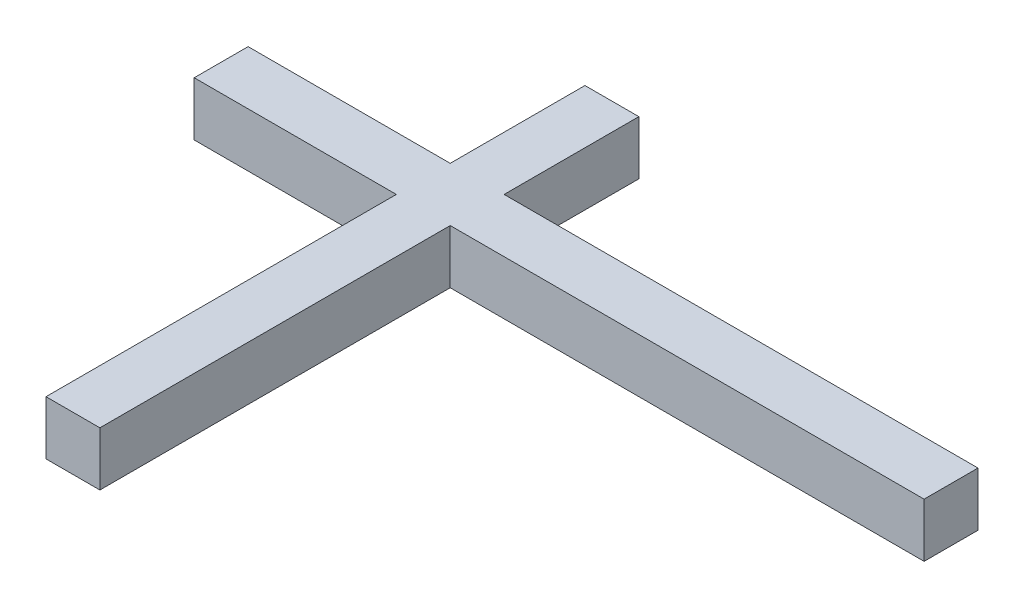
ISO-10303-21;
HEADER;
FILE_DESCRIPTION(('STEP AP214'),'2;1');
FILE_NAME('part.step','',(''),(''),'','','');
FILE_SCHEMA(('AUTOMOTIVE_DESIGN { 1 0 10303 214 1 1 1 1 }'));
ENDSEC;
DATA;
#1=APPLICATION_CONTEXT('core data for automotive mechanical design processes');
#2=APPLICATION_PROTOCOL_DEFINITION('international standard','automotive_design',2000,#1);
#3=PRODUCT_CONTEXT('',#1,'mechanical');
#4=PRODUCT('Part','Part','',(#3));
#5=PRODUCT_RELATED_PRODUCT_CATEGORY('part','',(#4));
#6=PRODUCT_DEFINITION_FORMATION('','',#4);
#7=PRODUCT_DEFINITION_CONTEXT('part definition',#1,'design');
#8=PRODUCT_DEFINITION('design','',#6,#7);
#9=PRODUCT_DEFINITION_SHAPE('','',#8);
#10=(LENGTH_UNIT() NAMED_UNIT(*) SI_UNIT(.MILLI.,.METRE.));
#11=(NAMED_UNIT(*) PLANE_ANGLE_UNIT() SI_UNIT($,.RADIAN.));
#12=(NAMED_UNIT(*) SI_UNIT($,.STERADIAN.) SOLID_ANGLE_UNIT());
#13=UNCERTAINTY_MEASURE_WITH_UNIT(LENGTH_MEASURE(1.E-05),#10,'distance_accuracy_value','');
#14=(GEOMETRIC_REPRESENTATION_CONTEXT(3) GLOBAL_UNCERTAINTY_ASSIGNED_CONTEXT((#13)) GLOBAL_UNIT_ASSIGNED_CONTEXT((#10,
#11,#12)) REPRESENTATION_CONTEXT('',''));
#15=CARTESIAN_POINT('',(0.,0.,0.));
#16=DIRECTION('',(0.,0.,1.));
#17=DIRECTION('',(1.,0.,0.));
#18=AXIS2_PLACEMENT_3D('',#15,#16,#17);
#19=CARTESIAN_POINT('',(-9.36299940445662,8.,0.));
#20=DIRECTION('',(1.,0.,0.));
#21=DIRECTION('',(0.,0.,-1.));
#22=AXIS2_PLACEMENT_3D('',#19,#20,#21);
#23=PLANE('',#22);
#24=DIRECTION('',(0.,0.,1.));
#25=VECTOR('',#24,1.);
#26=CARTESIAN_POINT('',(-9.36299940445662,0.,0.));
#27=LINE('',#26,#25);
#28=CARTESIAN_POINT('',(-9.36299940445662,0.,0.));
#29=VERTEX_POINT('',#28);
#30=CARTESIAN_POINT('',(-9.36299940445662,0.,20.));
#31=VERTEX_POINT('',#30);
#32=EDGE_CURVE('E155',#29,#31,#27,.T.);
#33=ORIENTED_EDGE('',*,*,#32,.T.);
#34=DIRECTION('',(0.,-1.,0.));
#35=VECTOR('',#34,1.);
#36=CARTESIAN_POINT('',(-9.36299940445662,8.,20.));
#37=LINE('',#36,#35);
#38=CARTESIAN_POINT('',(-9.36299940445662,8.,20.));
#39=VERTEX_POINT('',#38);
#40=EDGE_CURVE('E11',#39,#31,#37,.T.);
#41=ORIENTED_EDGE('',*,*,#40,.F.);
#42=DIRECTION('',(0.,0.,1.));
#43=VECTOR('',#42,1.);
#44=CARTESIAN_POINT('',(-9.36299940445662,8.,0.));
#45=LINE('',#44,#43);
#46=CARTESIAN_POINT('',(-9.36299940445662,8.,0.));
#47=VERTEX_POINT('',#46);
#48=EDGE_CURVE('E177',#47,#39,#45,.T.);
#49=ORIENTED_EDGE('',*,*,#48,.F.);
#50=DIRECTION('',(0.,-1.,0.));
#51=VECTOR('',#50,1.);
#52=CARTESIAN_POINT('',(-9.36299940445662,8.,0.));
#53=LINE('',#52,#51);
#54=EDGE_CURVE('E151',#47,#29,#53,.T.);
#55=ORIENTED_EDGE('',*,*,#54,.T.);
#56=EDGE_LOOP('',(#33,#41,#49,#55));
#57=FACE_BOUND('',#56,.T.);
#58=ADVANCED_FACE('F35',(#57),#23,.F.);
#59=CARTESIAN_POINT('',(-39.3629994044566,8.,20.));
#60=DIRECTION('',(0.,0.,1.));
#61=DIRECTION('',(1.,0.,0.));
#62=AXIS2_PLACEMENT_3D('',#59,#60,#61);
#63=PLANE('',#62);
#64=DIRECTION('',(-1.,0.,0.));
#65=VECTOR('',#64,1.);
#66=CARTESIAN_POINT('',(-39.3629994044566,0.,20.));
#67=LINE('',#66,#65);
#68=CARTESIAN_POINT('',(-39.3629994044566,0.,20.));
#69=VERTEX_POINT('',#68);
#70=EDGE_CURVE('E158',#31,#69,#67,.T.);
#71=ORIENTED_EDGE('',*,*,#70,.T.);
#72=DIRECTION('',(0.,-1.,0.));
#73=VECTOR('',#72,1.);
#74=CARTESIAN_POINT('',(-39.3629994044566,8.,20.));
#75=LINE('',#74,#73);
#76=CARTESIAN_POINT('',(-39.3629994044566,8.,20.));
#77=VERTEX_POINT('',#76);
#78=EDGE_CURVE('E43',#77,#69,#75,.T.);
#79=ORIENTED_EDGE('',*,*,#78,.F.);
#80=DIRECTION('',(-1.,0.,0.));
#81=VECTOR('',#80,1.);
#82=CARTESIAN_POINT('',(-39.3629994044566,8.,20.));
#83=LINE('',#82,#81);
#84=EDGE_CURVE('E106',#39,#77,#83,.T.);
#85=ORIENTED_EDGE('',*,*,#84,.F.);
#86=ORIENTED_EDGE('',*,*,#40,.T.);
#87=EDGE_LOOP('',(#71,#79,#85,#86));
#88=FACE_BOUND('',#87,.T.);
#89=ADVANCED_FACE('F255',(#88),#63,.F.);
#90=CARTESIAN_POINT('',(-39.3629994044566,8.,20.));
#91=DIRECTION('',(1.,0.,0.));
#92=DIRECTION('',(0.,0.,-1.));
#93=AXIS2_PLACEMENT_3D('',#90,#91,#92);
#94=PLANE('',#93);
#95=DIRECTION('',(0.,0.,1.));
#96=VECTOR('',#95,1.);
#97=CARTESIAN_POINT('',(-39.3629994044566,0.,20.));
#98=LINE('',#97,#96);
#99=CARTESIAN_POINT('',(-39.3629994044566,0.,28.));
#100=VERTEX_POINT('',#99);
#101=EDGE_CURVE('E160',#69,#100,#98,.T.);
#102=ORIENTED_EDGE('',*,*,#101,.T.);
#103=DIRECTION('',(0.,-1.,0.));
#104=VECTOR('',#103,1.);
#105=CARTESIAN_POINT('',(-39.3629994044566,8.,28.));
#106=LINE('',#105,#104);
#107=CARTESIAN_POINT('',(-39.3629994044566,8.,28.));
#108=VERTEX_POINT('',#107);
#109=EDGE_CURVE('E196',#108,#100,#106,.T.);
#110=ORIENTED_EDGE('',*,*,#109,.F.);
#111=DIRECTION('',(0.,0.,1.));
#112=VECTOR('',#111,1.);
#113=CARTESIAN_POINT('',(-39.3629994044566,8.,20.));
#114=LINE('',#113,#112);
#115=EDGE_CURVE('E204',#77,#108,#114,.T.);
#116=ORIENTED_EDGE('',*,*,#115,.F.);
#117=ORIENTED_EDGE('',*,*,#78,.T.);
#118=EDGE_LOOP('',(#102,#110,#116,#117));
#119=FACE_BOUND('',#118,.T.);
#120=ADVANCED_FACE('F202',(#119),#94,.F.);
#121=CARTESIAN_POINT('',(-39.3629994044566,8.,28.));
#122=DIRECTION('',(0.,0.,-1.));
#123=DIRECTION('',(-1.,0.,0.));
#124=AXIS2_PLACEMENT_3D('',#121,#122,#123);
#125=PLANE('',#124);
#126=DIRECTION('',(1.,0.,0.));
#127=VECTOR('',#126,1.);
#128=CARTESIAN_POINT('',(-39.3629994044566,0.,28.));
#129=LINE('',#128,#127);
#130=CARTESIAN_POINT('',(-9.36299940445662,0.,28.));
#131=VERTEX_POINT('',#130);
#132=EDGE_CURVE('E162',#100,#131,#129,.T.);
#133=ORIENTED_EDGE('',*,*,#132,.T.);
#134=DIRECTION('',(0.,-1.,0.));
#135=VECTOR('',#134,1.);
#136=CARTESIAN_POINT('',(-9.36299940445662,8.,28.));
#137=LINE('',#136,#135);
#138=CARTESIAN_POINT('',(-9.36299940445662,8.,28.));
#139=VERTEX_POINT('',#138);
#140=EDGE_CURVE('E193',#139,#131,#137,.T.);
#141=ORIENTED_EDGE('',*,*,#140,.F.);
#142=DIRECTION('',(1.,0.,0.));
#143=VECTOR('',#142,1.);
#144=CARTESIAN_POINT('',(-39.3629994044566,8.,28.));
#145=LINE('',#144,#143);
#146=EDGE_CURVE('E222',#108,#139,#145,.T.);
#147=ORIENTED_EDGE('',*,*,#146,.F.);
#148=ORIENTED_EDGE('',*,*,#109,.T.);
#149=EDGE_LOOP('',(#133,#141,#147,#148));
#150=FACE_BOUND('',#149,.T.);
#151=ADVANCED_FACE('F213',(#150),#125,.F.);
#152=CARTESIAN_POINT('',(-9.36299940445662,8.,28.));
#153=DIRECTION('',(1.,0.,0.));
#154=DIRECTION('',(0.,0.,-1.));
#155=AXIS2_PLACEMENT_3D('',#152,#153,#154);
#156=PLANE('',#155);
#157=DIRECTION('',(0.,0.,1.));
#158=VECTOR('',#157,1.);
#159=CARTESIAN_POINT('',(-9.36299940445662,0.,28.));
#160=LINE('',#159,#158);
#161=CARTESIAN_POINT('',(-9.36299940445661,0.,80.));
#162=VERTEX_POINT('',#161);
#163=EDGE_CURVE('E164',#131,#162,#160,.T.);
#164=ORIENTED_EDGE('',*,*,#163,.T.);
#165=DIRECTION('',(0.,-1.,0.));
#166=VECTOR('',#165,1.);
#167=CARTESIAN_POINT('',(-9.36299940445661,8.,80.));
#168=LINE('',#167,#166);
#169=CARTESIAN_POINT('',(-9.36299940445661,8.,80.));
#170=VERTEX_POINT('',#169);
#171=EDGE_CURVE('E190',#170,#162,#168,.T.);
#172=ORIENTED_EDGE('',*,*,#171,.F.);
#173=DIRECTION('',(0.,0.,1.));
#174=VECTOR('',#173,1.);
#175=CARTESIAN_POINT('',(-9.36299940445662,8.,28.));
#176=LINE('',#175,#174);
#177=EDGE_CURVE('E219',#139,#170,#176,.T.);
#178=ORIENTED_EDGE('',*,*,#177,.F.);
#179=ORIENTED_EDGE('',*,*,#140,.T.);
#180=EDGE_LOOP('',(#164,#172,#178,#179));
#181=FACE_BOUND('',#180,.T.);
#182=ADVANCED_FACE('F217',(#181),#156,.F.);
#183=CARTESIAN_POINT('',(-9.36299940445661,8.,80.));
#184=DIRECTION('',(0.,0.,-1.));
#185=DIRECTION('',(-1.,0.,0.));
#186=AXIS2_PLACEMENT_3D('',#183,#184,#185);
#187=PLANE('',#186);
#188=DIRECTION('',(1.,0.,0.));
#189=VECTOR('',#188,1.);
#190=CARTESIAN_POINT('',(-9.36299940445661,0.,80.));
#191=LINE('',#190,#189);
#192=CARTESIAN_POINT('',(-1.36299940445661,0.,80.));
#193=VERTEX_POINT('',#192);
#194=EDGE_CURVE('E166',#162,#193,#191,.T.);
#195=ORIENTED_EDGE('',*,*,#194,.T.);
#196=DIRECTION('',(0.,-1.,0.));
#197=VECTOR('',#196,1.);
#198=CARTESIAN_POINT('',(-1.36299940445661,8.,80.));
#199=LINE('',#198,#197);
#200=CARTESIAN_POINT('',(-1.36299940445661,8.,80.));
#201=VERTEX_POINT('',#200);
#202=EDGE_CURVE('E187',#201,#193,#199,.T.);
#203=ORIENTED_EDGE('',*,*,#202,.F.);
#204=DIRECTION('',(1.,0.,0.));
#205=VECTOR('',#204,1.);
#206=CARTESIAN_POINT('',(-9.36299940445661,8.,80.));
#207=LINE('',#206,#205);
#208=EDGE_CURVE('E221',#170,#201,#207,.T.);
#209=ORIENTED_EDGE('',*,*,#208,.F.);
#210=ORIENTED_EDGE('',*,*,#171,.T.);
#211=EDGE_LOOP('',(#195,#203,#209,#210));
#212=FACE_BOUND('',#211,.T.);
#213=ADVANCED_FACE('F268',(#212),#187,.F.);
#214=CARTESIAN_POINT('',(-1.36299940445662,8.,28.));
#215=DIRECTION('',(-1.,0.,0.));
#216=DIRECTION('',(0.,0.,1.));
#217=AXIS2_PLACEMENT_3D('',#214,#215,#216);
#218=PLANE('',#217);
#219=DIRECTION('',(0.,0.,-1.));
#220=VECTOR('',#219,1.);
#221=CARTESIAN_POINT('',(-1.36299940445662,0.,28.));
#222=LINE('',#221,#220);
#223=CARTESIAN_POINT('',(-1.36299940445662,0.,28.));
#224=VERTEX_POINT('',#223);
#225=EDGE_CURVE('E168',#193,#224,#222,.T.);
#226=ORIENTED_EDGE('',*,*,#225,.T.);
#227=DIRECTION('',(0.,-1.,0.));
#228=VECTOR('',#227,1.);
#229=CARTESIAN_POINT('',(-1.36299940445662,8.,28.));
#230=LINE('',#229,#228);
#231=CARTESIAN_POINT('',(-1.36299940445662,8.,28.));
#232=VERTEX_POINT('',#231);
#233=EDGE_CURVE('E184',#232,#224,#230,.T.);
#234=ORIENTED_EDGE('',*,*,#233,.F.);
#235=DIRECTION('',(0.,0.,-1.));
#236=VECTOR('',#235,1.);
#237=CARTESIAN_POINT('',(-1.36299940445662,8.,28.));
#238=LINE('',#237,#236);
#239=EDGE_CURVE('E224',#201,#232,#238,.T.);
#240=ORIENTED_EDGE('',*,*,#239,.F.);
#241=ORIENTED_EDGE('',*,*,#202,.T.);
#242=EDGE_LOOP('',(#226,#234,#240,#241));
#243=FACE_BOUND('',#242,.T.);
#244=ADVANCED_FACE('F271',(#243),#218,.F.);
#245=CARTESIAN_POINT('',(-1.36299940445662,8.,28.));
#246=DIRECTION('',(0.,0.,-1.));
#247=DIRECTION('',(-1.,0.,0.));
#248=AXIS2_PLACEMENT_3D('',#245,#246,#247);
#249=PLANE('',#248);
#250=DIRECTION('',(1.,0.,0.));
#251=VECTOR('',#250,1.);
#252=CARTESIAN_POINT('',(-1.36299940445662,0.,28.));
#253=LINE('',#252,#251);
#254=CARTESIAN_POINT('',(68.9785597355549,0.,28.));
#255=VERTEX_POINT('',#254);
#256=EDGE_CURVE('E170',#224,#255,#253,.T.);
#257=ORIENTED_EDGE('',*,*,#256,.T.);
#258=DIRECTION('',(0.,-1.,0.));
#259=VECTOR('',#258,1.);
#260=CARTESIAN_POINT('',(68.9785597355549,8.,28.));
#261=LINE('',#260,#259);
#262=CARTESIAN_POINT('',(68.9785597355549,8.,28.));
#263=VERTEX_POINT('',#262);
#264=EDGE_CURVE('E181',#263,#255,#261,.T.);
#265=ORIENTED_EDGE('',*,*,#264,.F.);
#266=DIRECTION('',(1.,0.,0.));
#267=VECTOR('',#266,1.);
#268=CARTESIAN_POINT('',(-1.36299940445662,8.,28.));
#269=LINE('',#268,#267);
#270=EDGE_CURVE('E230',#232,#263,#269,.T.);
#271=ORIENTED_EDGE('',*,*,#270,.F.);
#272=ORIENTED_EDGE('',*,*,#233,.T.);
#273=EDGE_LOOP('',(#257,#265,#271,#272));
#274=FACE_BOUND('',#273,.T.);
#275=ADVANCED_FACE('F236',(#274),#249,.F.);
#276=CARTESIAN_POINT('',(68.9785597355549,8.,20.));
#277=DIRECTION('',(-1.,0.,0.));
#278=DIRECTION('',(0.,0.,1.));
#279=AXIS2_PLACEMENT_3D('',#276,#277,#278);
#280=PLANE('',#279);
#281=DIRECTION('',(0.,0.,-1.));
#282=VECTOR('',#281,1.);
#283=CARTESIAN_POINT('',(68.9785597355549,0.,20.));
#284=LINE('',#283,#282);
#285=CARTESIAN_POINT('',(68.9785597355549,0.,20.));
#286=VERTEX_POINT('',#285);
#287=EDGE_CURVE('E172',#255,#286,#284,.T.);
#288=ORIENTED_EDGE('',*,*,#287,.T.);
#289=DIRECTION('',(0.,-1.,0.));
#290=VECTOR('',#289,1.);
#291=CARTESIAN_POINT('',(68.9785597355549,8.,20.));
#292=LINE('',#291,#290);
#293=CARTESIAN_POINT('',(68.9785597355549,8.,20.));
#294=VERTEX_POINT('',#293);
#295=EDGE_CURVE('E146',#294,#286,#292,.T.);
#296=ORIENTED_EDGE('',*,*,#295,.F.);
#297=DIRECTION('',(0.,0.,-1.));
#298=VECTOR('',#297,1.);
#299=CARTESIAN_POINT('',(68.9785597355549,8.,20.));
#300=LINE('',#299,#298);
#301=EDGE_CURVE('E137',#263,#294,#300,.T.);
#302=ORIENTED_EDGE('',*,*,#301,.F.);
#303=ORIENTED_EDGE('',*,*,#264,.T.);
#304=EDGE_LOOP('',(#288,#296,#302,#303));
#305=FACE_BOUND('',#304,.T.);
#306=ADVANCED_FACE('F240',(#305),#280,.F.);
#307=CARTESIAN_POINT('',(-1.36299940445662,8.,20.));
#308=DIRECTION('',(0.,0.,1.));
#309=DIRECTION('',(1.,0.,0.));
#310=AXIS2_PLACEMENT_3D('',#307,#308,#309);
#311=PLANE('',#310);
#312=DIRECTION('',(-1.,0.,0.));
#313=VECTOR('',#312,1.);
#314=CARTESIAN_POINT('',(-1.36299940445662,0.,20.));
#315=LINE('',#314,#313);
#316=CARTESIAN_POINT('',(-1.36299940445662,0.,20.));
#317=VERTEX_POINT('',#316);
#318=EDGE_CURVE('E145',#286,#317,#315,.T.);
#319=ORIENTED_EDGE('',*,*,#318,.T.);
#320=DIRECTION('',(0.,-1.,0.));
#321=VECTOR('',#320,1.);
#322=CARTESIAN_POINT('',(-1.36299940445662,8.,20.));
#323=LINE('',#322,#321);
#324=CARTESIAN_POINT('',(-1.36299940445662,8.,20.));
#325=VERTEX_POINT('',#324);
#326=EDGE_CURVE('E142',#325,#317,#323,.T.);
#327=ORIENTED_EDGE('',*,*,#326,.F.);
#328=DIRECTION('',(-1.,0.,0.));
#329=VECTOR('',#328,1.);
#330=CARTESIAN_POINT('',(-1.36299940445662,8.,20.));
#331=LINE('',#330,#329);
#332=EDGE_CURVE('E131',#294,#325,#331,.T.);
#333=ORIENTED_EDGE('',*,*,#332,.F.);
#334=ORIENTED_EDGE('',*,*,#295,.T.);
#335=EDGE_LOOP('',(#319,#327,#333,#334));
#336=FACE_BOUND('',#335,.T.);
#337=ADVANCED_FACE('F143',(#336),#311,.F.);
#338=CARTESIAN_POINT('',(-1.36299940445662,8.,0.));
#339=DIRECTION('',(-1.,0.,0.));
#340=DIRECTION('',(0.,0.,1.));
#341=AXIS2_PLACEMENT_3D('',#338,#339,#340);
#342=PLANE('',#341);
#343=DIRECTION('',(0.,0.,-1.));
#344=VECTOR('',#343,1.);
#345=CARTESIAN_POINT('',(-1.36299940445662,0.,0.));
#346=LINE('',#345,#344);
#347=CARTESIAN_POINT('',(-1.36299940445662,0.,0.));
#348=VERTEX_POINT('',#347);
#349=EDGE_CURVE('E92',#317,#348,#346,.T.);
#350=ORIENTED_EDGE('',*,*,#349,.T.);
#351=DIRECTION('',(0.,-1.,0.));
#352=VECTOR('',#351,1.);
#353=CARTESIAN_POINT('',(-1.36299940445662,8.,0.));
#354=LINE('',#353,#352);
#355=CARTESIAN_POINT('',(-1.36299940445662,8.,0.));
#356=VERTEX_POINT('',#355);
#357=EDGE_CURVE('E147',#356,#348,#354,.T.);
#358=ORIENTED_EDGE('',*,*,#357,.F.);
#359=DIRECTION('',(0.,0.,-1.));
#360=VECTOR('',#359,1.);
#361=CARTESIAN_POINT('',(-1.36299940445662,8.,0.));
#362=LINE('',#361,#360);
#363=EDGE_CURVE('E135',#325,#356,#362,.T.);
#364=ORIENTED_EDGE('',*,*,#363,.F.);
#365=ORIENTED_EDGE('',*,*,#326,.T.);
#366=EDGE_LOOP('',(#350,#358,#364,#365));
#367=FACE_BOUND('',#366,.T.);
#368=ADVANCED_FACE('F149',(#367),#342,.F.);
#369=CARTESIAN_POINT('',(-9.36299940445662,8.,0.));
#370=DIRECTION('',(0.,0.,1.));
#371=DIRECTION('',(1.,0.,0.));
#372=AXIS2_PLACEMENT_3D('',#369,#370,#371);
#373=PLANE('',#372);
#374=DIRECTION('',(-1.,0.,0.));
#375=VECTOR('',#374,1.);
#376=CARTESIAN_POINT('',(-9.36299940445662,0.,0.));
#377=LINE('',#376,#375);
#378=EDGE_CURVE('E98',#348,#29,#377,.T.);
#379=ORIENTED_EDGE('',*,*,#378,.T.);
#380=ORIENTED_EDGE('',*,*,#54,.F.);
#381=DIRECTION('',(-1.,0.,0.));
#382=VECTOR('',#381,1.);
#383=CARTESIAN_POINT('',(-9.36299940445662,8.,0.));
#384=LINE('',#383,#382);
#385=EDGE_CURVE('E51',#356,#47,#384,.T.);
#386=ORIENTED_EDGE('',*,*,#385,.F.);
#387=ORIENTED_EDGE('',*,*,#357,.T.);
#388=EDGE_LOOP('',(#379,#380,#386,#387));
#389=FACE_BOUND('',#388,.T.);
#390=ADVANCED_FACE('F244',(#389),#373,.F.);
#391=CARTESIAN_POINT('',(0.,8.,0.));
#392=DIRECTION('',(0.,1.,0.));
#393=DIRECTION('',(0.,0.,1.));
#394=AXIS2_PLACEMENT_3D('',#391,#392,#393);
#395=PLANE('',#394);
#396=ORIENTED_EDGE('',*,*,#48,.T.);
#397=ORIENTED_EDGE('',*,*,#84,.T.);
#398=ORIENTED_EDGE('',*,*,#115,.T.);
#399=ORIENTED_EDGE('',*,*,#146,.T.);
#400=ORIENTED_EDGE('',*,*,#177,.T.);
#401=ORIENTED_EDGE('',*,*,#208,.T.);
#402=ORIENTED_EDGE('',*,*,#239,.T.);
#403=ORIENTED_EDGE('',*,*,#270,.T.);
#404=ORIENTED_EDGE('',*,*,#301,.T.);
#405=ORIENTED_EDGE('',*,*,#332,.T.);
#406=ORIENTED_EDGE('',*,*,#363,.T.);
#407=ORIENTED_EDGE('',*,*,#385,.T.);
#408=EDGE_LOOP('',(#396,#397,#398,#399,#400,#401,#402,#403,#404,#405,#406,#407));
#409=FACE_BOUND('',#408,.T.);
#410=ADVANCED_FACE('F133',(#409),#395,.T.);
#411=CARTESIAN_POINT('',(0.,0.,0.));
#412=DIRECTION('',(0.,1.,0.));
#413=DIRECTION('',(0.,0.,1.));
#414=AXIS2_PLACEMENT_3D('',#411,#412,#413);
#415=PLANE('',#414);
#416=ORIENTED_EDGE('',*,*,#32,.F.);
#417=ORIENTED_EDGE('',*,*,#378,.F.);
#418=ORIENTED_EDGE('',*,*,#349,.F.);
#419=ORIENTED_EDGE('',*,*,#318,.F.);
#420=ORIENTED_EDGE('',*,*,#287,.F.);
#421=ORIENTED_EDGE('',*,*,#256,.F.);
#422=ORIENTED_EDGE('',*,*,#225,.F.);
#423=ORIENTED_EDGE('',*,*,#194,.F.);
#424=ORIENTED_EDGE('',*,*,#163,.F.);
#425=ORIENTED_EDGE('',*,*,#132,.F.);
#426=ORIENTED_EDGE('',*,*,#101,.F.);
#427=ORIENTED_EDGE('',*,*,#70,.F.);
#428=EDGE_LOOP('',(#416,#417,#418,#419,#420,#421,#422,#423,#424,#425,#426,#427));
#429=FACE_BOUND('',#428,.T.);
#430=ADVANCED_FACE('F208',(#429),#415,.F.);
#431=CLOSED_SHELL('',(#58,#89,#120,#151,#182,#213,#244,#275,#306,#337,#368,#390,#410,#430));
#432=MANIFOLD_SOLID_BREP('B2',#431);
#433=ADVANCED_BREP_SHAPE_REPRESENTATION('',(#18,#432),#14);
#434=SHAPE_DEFINITION_REPRESENTATION(#9,#433);
ENDSEC;
END-ISO-10303-21;
